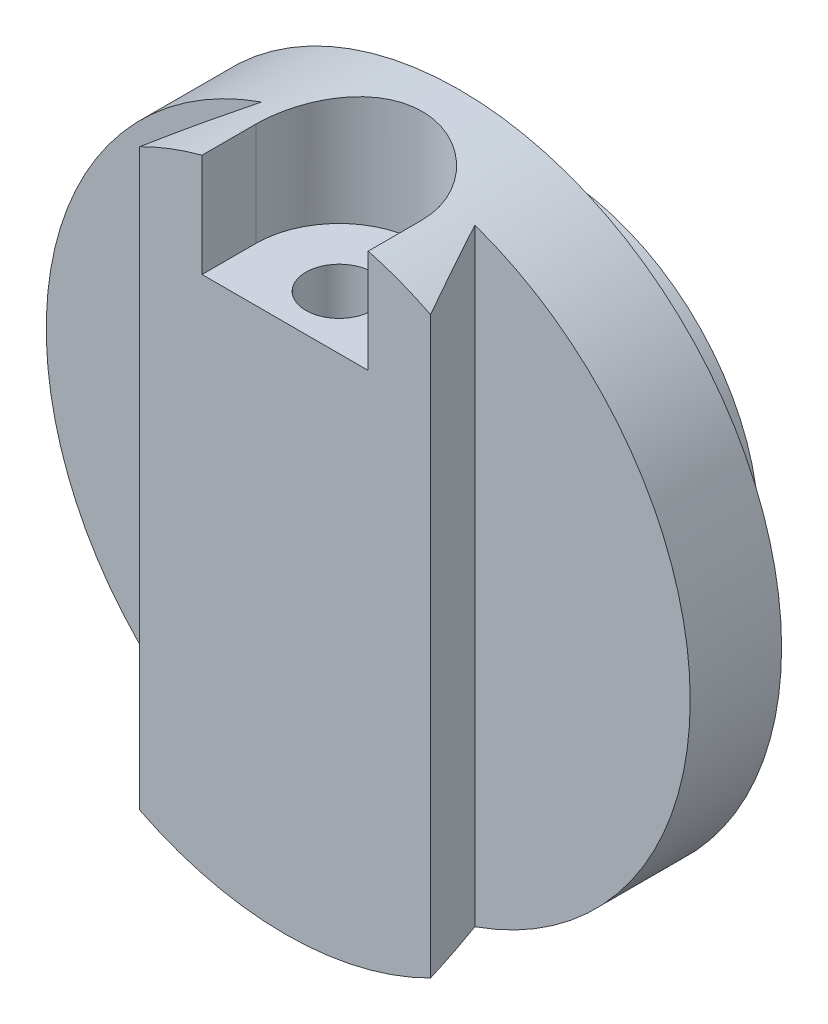
ISO-10303-21;
HEADER;
FILE_DESCRIPTION(('STEP AP214'),'2;1');
FILE_NAME('part.step','',(''),(''),'','','');
FILE_SCHEMA(('AUTOMOTIVE_DESIGN { 1 0 10303 214 1 1 1 1 }'));
ENDSEC;
DATA;
#1=APPLICATION_CONTEXT('core data for automotive mechanical design processes');
#2=APPLICATION_PROTOCOL_DEFINITION('international standard','automotive_design',2000,#1);
#3=PRODUCT_CONTEXT('',#1,'mechanical');
#4=PRODUCT('Part','Part','',(#3));
#5=PRODUCT_RELATED_PRODUCT_CATEGORY('part','',(#4));
#6=PRODUCT_DEFINITION_FORMATION('','',#4);
#7=PRODUCT_DEFINITION_CONTEXT('part definition',#1,'design');
#8=PRODUCT_DEFINITION('design','',#6,#7);
#9=PRODUCT_DEFINITION_SHAPE('','',#8);
#10=(LENGTH_UNIT() NAMED_UNIT(*) SI_UNIT(.MILLI.,.METRE.));
#11=(NAMED_UNIT(*) PLANE_ANGLE_UNIT() SI_UNIT($,.RADIAN.));
#12=(NAMED_UNIT(*) SI_UNIT($,.STERADIAN.) SOLID_ANGLE_UNIT());
#13=UNCERTAINTY_MEASURE_WITH_UNIT(LENGTH_MEASURE(1.E-05),#10,'distance_accuracy_value','');
#14=(GEOMETRIC_REPRESENTATION_CONTEXT(3) GLOBAL_UNCERTAINTY_ASSIGNED_CONTEXT((#13)) GLOBAL_UNIT_ASSIGNED_CONTEXT((#10,
#11,#12)) REPRESENTATION_CONTEXT('',''));
#15=CARTESIAN_POINT('',(0.,0.,0.));
#16=DIRECTION('',(0.,0.,1.));
#17=DIRECTION('',(1.,0.,0.));
#18=AXIS2_PLACEMENT_3D('',#15,#16,#17);
#19=CARTESIAN_POINT('',(0.,0.,64.));
#20=DIRECTION('',(0.,0.,-1.));
#21=DIRECTION('',(-1.,0.,0.));
#22=AXIS2_PLACEMENT_3D('',#19,#20,#21);
#23=CYLINDRICAL_SURFACE('',#22,77.5);
#24=CARTESIAN_POINT('',(0.,-77.5,58.9999999999999));
#25=CARTESIAN_POINT('',(0.22412144041309,-77.5000006289321,59.0000022456174));
#26=CARTESIAN_POINT('',(0.448208760643072,-77.4990258403276,58.9905782649997));
#27=CARTESIAN_POINT('',(0.894856484115019,-77.4951552624996,58.9529525780493));
#28=CARTESIAN_POINT('',(1.11741651072026,-77.4922590155015,58.9247463969774));
#29=CARTESIAN_POINT('',(1.5595222457554,-77.4846231282553,58.8497266191283));
#30=CARTESIAN_POINT('',(1.77906542690297,-77.4798820296715,58.8028983011046));
#31=CARTESIAN_POINT('',(2.21348185336275,-77.4686886840392,58.69095745594));
#32=CARTESIAN_POINT('',(2.42835335836776,-77.4622358107438,58.6258382366232));
#33=CARTESIAN_POINT('',(2.85164760131742,-77.4478077302911,58.4778563410954));
#34=CARTESIAN_POINT('',(3.06007541873765,-77.439833759692,58.3950080708902));
#35=CARTESIAN_POINT('',(3.4692011726306,-77.4225843642534,58.2121322102676));
#36=CARTESIAN_POINT('',(3.66989896334979,-77.4133089148891,58.1121042961133));
#37=CARTESIAN_POINT('',(4.06211045206069,-77.3937194475438,57.8956089506082));
#38=CARTESIAN_POINT('',(4.25362618380569,-77.3834056611296,57.7791451824161));
#39=CARTESIAN_POINT('',(4.62618990430687,-77.3620267956708,57.5305830733126));
#40=CARTESIAN_POINT('',(4.80723761980854,-77.3509616970305,57.3984843245435));
#41=CARTESIAN_POINT('',(5.1581638018345,-77.3283542274609,57.1191342598021));
#42=CARTESIAN_POINT('',(5.32800446372237,-77.3168104356773,56.9718355657215));
#43=CARTESIAN_POINT('',(5.65474382854309,-77.2936007272178,56.6634229167924));
#44=CARTESIAN_POINT('',(5.81163802450728,-77.2819347695924,56.502304190343));
#45=CARTESIAN_POINT('',(6.11129737925743,-77.2588158807326,56.1674479791581));
#46=CARTESIAN_POINT('',(6.25406441089398,-77.2473629214248,55.9937121723893));
#47=CARTESIAN_POINT('',(6.52448854623247,-77.22499248345,55.6348175347842));
#48=CARTESIAN_POINT('',(6.65214542874813,-77.2140750126231,55.4496585367926));
#49=CARTESIAN_POINT('',(6.89171122560251,-77.1930619565953,55.0687889262736));
#50=CARTESIAN_POINT('',(7.00358400285714,-77.1829682789962,54.8730554755148));
#51=CARTESIAN_POINT('',(7.21043841339032,-77.1639188511048,54.4727982359632));
#52=CARTESIAN_POINT('',(7.3054196408647,-77.1549631281524,54.2682742361319));
#53=CARTESIAN_POINT('',(7.477781995392,-77.1384487520527,53.8519340433341));
#54=CARTESIAN_POINT('',(7.55516674049758,-77.1308898117697,53.6401193597526));
#55=CARTESIAN_POINT('',(7.6918195263402,-77.1173821713805,53.2105929368656));
#56=CARTESIAN_POINT('',(7.75108131476702,-77.1114340270698,52.9928791905544));
#57=CARTESIAN_POINT('',(7.85082747054436,-77.1013424937746,52.5540128253052));
#58=CARTESIAN_POINT('',(7.89138162571125,-77.0971924008391,52.3328762207178));
#59=CARTESIAN_POINT('',(7.95374235887186,-77.0907839330074,51.8879447790906));
#60=CARTESIAN_POINT('',(7.97554871346777,-77.0885255806531,51.6641499104074));
#61=CARTESIAN_POINT('',(8.00025127878499,-77.085965873048,51.2155174174074));
#62=CARTESIAN_POINT('',(8.00314830117601,-77.0856644337981,50.9906798382628));
#63=CARTESIAN_POINT('',(7.99001273813123,-77.0870270519928,50.5415595704086));
#64=CARTESIAN_POINT('',(7.9739797720361,-77.088691148962,50.3172768929483));
#65=CARTESIAN_POINT('',(7.92320564265994,-77.0939262108477,49.8717850305153));
#66=CARTESIAN_POINT('',(7.88854065438163,-77.0974894109924,49.6505670671124));
#67=CARTESIAN_POINT('',(7.80078982902067,-77.1064175076918,49.2117731379946));
#68=CARTESIAN_POINT('',(7.74769764521342,-77.111783024983,48.9941984542036));
#69=CARTESIAN_POINT('',(7.62349169311528,-77.1241613544967,48.5643447660147));
#70=CARTESIAN_POINT('',(7.55238102981571,-77.1311738828867,48.3520648561235));
#71=CARTESIAN_POINT('',(7.39264525299236,-77.1466475608227,47.9342507453281));
#72=CARTESIAN_POINT('',(7.30401978952844,-77.1551087393117,47.7287166792995));
#73=CARTESIAN_POINT('',(7.10970680130189,-77.1732570453895,47.3254582479223));
#74=CARTESIAN_POINT('',(7.00398752268007,-77.1829464471736,47.1277492863368));
#75=CARTESIAN_POINT('',(6.77635621224708,-77.2032644867963,46.7419292841438));
#76=CARTESIAN_POINT('',(6.65444380793458,-77.2138931462393,46.5538184644667));
#77=CARTESIAN_POINT('',(6.39530953848221,-77.2357877785603,46.1885394167798));
#78=CARTESIAN_POINT('',(6.25809007618134,-77.2470536512745,46.01136947808));
#79=CARTESIAN_POINT('',(5.96923867604752,-77.2699112153228,45.6691134987661));
#80=CARTESIAN_POINT('',(5.81760174913516,-77.2815030184589,45.504031676411));
#81=CARTESIAN_POINT('',(5.5002974737331,-77.3047355593271,45.1864520561252));
#82=CARTESIAN_POINT('',(5.33456974313492,-77.3163762811419,45.0340145802931));
#83=CARTESIAN_POINT('',(4.99084224557343,-77.3393247688625,44.7436342848612));
#84=CARTESIAN_POINT('',(4.81284228003316,-77.3506325293763,44.6056916998944));
#85=CARTESIAN_POINT('',(4.44582570714483,-77.3725947740679,44.3452827769776));
#86=CARTESIAN_POINT('',(4.25680925661626,-77.3832492675404,44.2228162188051));
#87=CARTESIAN_POINT('',(3.86908368170646,-77.4036037399262,43.9942282217026));
#88=CARTESIAN_POINT('',(3.67037435744399,-77.4133036991431,43.8881071200275));
#89=CARTESIAN_POINT('',(3.26466756370417,-77.4314740415084,43.6929749749447));
#90=CARTESIAN_POINT('',(3.05766999748072,-77.4399444102988,43.6039641313301));
#91=CARTESIAN_POINT('',(2.63678409197879,-77.4554176656049,43.4436717536236));
#92=CARTESIAN_POINT('',(2.4228933842077,-77.462420041378,43.3723963884339));
#93=CARTESIAN_POINT('',(1.98990774693591,-77.4747516967645,43.2481632385807));
#94=CARTESIAN_POINT('',(1.77081506605635,-77.4800816856197,43.1951976879451));
#95=CARTESIAN_POINT('',(1.32880759873042,-77.488922761536,43.1079128321088));
#96=CARTESIAN_POINT('',(1.10589114796409,-77.4924330346764,43.0736018703805));
#97=CARTESIAN_POINT('',(0.658963993266934,-77.4975191796241,43.0240307777105));
#98=CARTESIAN_POINT('',(0.434962996988856,-77.4991038494751,43.0086839943209));
#99=CARTESIAN_POINT('',(-0.0134443765486324,-77.500322994829,42.9968694049881));
#100=CARTESIAN_POINT('',(-0.237850535116094,-77.4999583182518,43.0003933907053));
#101=CARTESIAN_POINT('',(-0.685610633888314,-77.4972907524117,43.0262782312841));
#102=CARTESIAN_POINT('',(-0.90896433653478,-77.4949874448335,43.0486431516181));
#103=CARTESIAN_POINT('',(-1.3529707516993,-77.4885073204368,43.1120497405359));
#104=CARTESIAN_POINT('',(-1.57362353842967,-77.4843305552141,43.1530908947695));
#105=CARTESIAN_POINT('',(-2.01018362661922,-77.4742327009578,43.2534384702333));
#106=CARTESIAN_POINT('',(-2.22610028707932,-77.4683154635325,43.3127045732758));
#107=CARTESIAN_POINT('',(-2.65216150328002,-77.4548995880078,43.4491012454989));
#108=CARTESIAN_POINT('',(-2.86230612489521,-77.4474009679649,43.5262316107051));
#109=CARTESIAN_POINT('',(-3.2753903415041,-77.4310309782942,43.6978189413456));
#110=CARTESIAN_POINT('',(-3.47832852645126,-77.4221593418152,43.7922792755925));
#111=CARTESIAN_POINT('',(-3.8754704492477,-77.4032960607971,43.9978072612485));
#112=CARTESIAN_POINT('',(-4.06967712664901,-77.3933047972087,44.1088692682441));
#113=CARTESIAN_POINT('',(-4.44878902133798,-77.3724399108398,44.3472858128548));
#114=CARTESIAN_POINT('',(-4.63365660521503,-77.3615631180707,44.4746999171251));
#115=CARTESIAN_POINT('',(-4.99200820091474,-77.3392661526231,44.7445889508585));
#116=CARTESIAN_POINT('',(-5.16549245691963,-77.3278459916094,44.8870635570896));
#117=CARTESIAN_POINT('',(-5.49987812285569,-77.3047827466601,45.1860814343108));
#118=CARTESIAN_POINT('',(-5.66077898234948,-77.2931396530003,45.3426253200925));
#119=CARTESIAN_POINT('',(-5.96886214250702,-77.2699589420821,45.6686783374357));
#120=CARTESIAN_POINT('',(-6.11604464102973,-77.2584213233044,45.838187281939));
#121=CARTESIAN_POINT('',(-6.39622728097,-77.2357308369963,46.1896989918624));
#122=CARTESIAN_POINT('',(-6.52916766408467,-77.2245797140181,46.3717495085912));
#123=CARTESIAN_POINT('',(-6.77918871074659,-77.2030332656618,46.7463784698501));
#124=CARTESIAN_POINT('',(-6.89627521392881,-77.1926376626518,46.9389530010661));
#125=CARTESIAN_POINT('',(-7.11384666245387,-77.1728911488181,47.3334027903196));
#126=CARTESIAN_POINT('',(-7.21432577171023,-77.1635406056162,47.5352812861733));
#127=CARTESIAN_POINT('',(-7.39787428000679,-77.1461597040211,47.9467735119188));
#128=CARTESIAN_POINT('',(-7.4809497974271,-77.1381288818835,48.1563844928081));
#129=CARTESIAN_POINT('',(-7.62900614292368,-77.1236266879278,48.5815596708896));
#130=CARTESIAN_POINT('',(-7.69401714740278,-77.1171527178847,48.7971132706638));
#131=CARTESIAN_POINT('',(-7.80565250209555,-77.1059332347639,49.232969758358));
#132=CARTESIAN_POINT('',(-7.85227727249769,-77.1011876821861,49.4532725376216));
#133=CARTESIAN_POINT('',(-7.9267984194321,-77.0935618091398,49.8970538393885));
#134=CARTESIAN_POINT('',(-7.95469492778901,-77.0906814755423,50.1205323395273));
#135=CARTESIAN_POINT('',(-7.99155312594365,-77.0868693320342,50.5690581791066));
#136=CARTESIAN_POINT('',(-8.00051517074663,-77.085937485591,50.7941054890539));
#137=CARTESIAN_POINT('',(-7.99944152492069,-77.0860488989122,51.2431338910804));
#138=CARTESIAN_POINT('',(-7.9894917014318,-77.0870832314715,51.4671151954));
#139=CARTESIAN_POINT('',(-7.95084370123036,-77.0910789941078,51.9133583671144));
#140=CARTESIAN_POINT('',(-7.92215206055208,-77.0940397523604,52.1356208066153));
#141=CARTESIAN_POINT('',(-7.84623013604892,-77.1018036521019,52.5769652111321));
#142=CARTESIAN_POINT('',(-7.79899646709564,-77.1066071300036,52.796046587819));
#143=CARTESIAN_POINT('',(-7.68633648416365,-77.117919010914,53.2294302024073));
#144=CARTESIAN_POINT('',(-7.62091054315141,-77.1244273789701,53.4437325381882));
#145=CARTESIAN_POINT('',(-7.47235068069638,-77.1389625281308,53.8660193985515));
#146=CARTESIAN_POINT('',(-7.38921937977867,-77.1469890845127,54.0740048528798));
#147=CARTESIAN_POINT('',(-7.2058414077743,-77.1643332499751,54.4822288683681));
#148=CARTESIAN_POINT('',(-7.10559493480162,-77.1736508441113,54.682467519167));
#149=CARTESIAN_POINT('',(-6.88868164692852,-77.1933152569996,55.0738346252506));
#150=CARTESIAN_POINT('',(-6.7720120798586,-77.2036622481719,55.2649615463976));
#151=CARTESIAN_POINT('',(-6.52313218976206,-77.2250887629648,55.6366753174278));
#152=CARTESIAN_POINT('',(-6.39092715127556,-77.2361680369346,55.8172657203074));
#153=CARTESIAN_POINT('',(-6.11121264176826,-77.2588043762888,56.1675478334074));
#154=CARTESIAN_POINT('',(-5.96363396201531,-77.2703634478196,56.3371841528292));
#155=CARTESIAN_POINT('',(-5.65473392080187,-77.293582955411,56.6634307272365));
#156=CARTESIAN_POINT('',(-5.49341283878869,-77.3052433894061,56.8200412469694));
#157=CARTESIAN_POINT('',(-5.15811288053115,-77.3283396378945,57.119179827032));
#158=CARTESIAN_POINT('',(-4.98413073900976,-77.3397753934709,57.2617042320561));
#159=CARTESIAN_POINT('',(-4.62476807922271,-77.3620961643922,57.5316168184361));
#160=CARTESIAN_POINT('',(-4.43938774560957,-77.3729811886539,57.6590052448993));
#161=CARTESIAN_POINT('',(-4.05798002344993,-77.3939233524935,57.8980866779505));
#162=CARTESIAN_POINT('',(-3.86192366629876,-77.4039780320949,58.0097336947715));
#163=CARTESIAN_POINT('',(-3.4611144725406,-77.4229353661449,58.2160567023354));
#164=CARTESIAN_POINT('',(-3.25636485548308,-77.4318384422312,58.3107389093395));
#165=CARTESIAN_POINT('',(-2.83972007448798,-77.4482369350069,58.4824266941205));
#166=CARTESIAN_POINT('',(-2.62783089319213,-77.4557334973127,58.559446669388));
#167=CARTESIAN_POINT('',(-2.19833332306081,-77.4691132476432,58.6953276309041));
#168=CARTESIAN_POINT('',(-1.98072634665206,-77.4749968300806,58.7541930568208));
#169=CARTESIAN_POINT('',(-1.47239361489212,-77.4865488610836,58.8688961990982));
#170=CARTESIAN_POINT('',(-1.18011114473312,-77.4915729017231,58.9180124800809));
#171=CARTESIAN_POINT('',(-0.591865946655075,-77.4982980485787,58.9835628251396));
#172=CARTESIAN_POINT('',(-0.295903235175733,-77.4999991696331,58.9999970351542));
#173=CARTESIAN_POINT('',(0.,-77.5,58.9999999999999));
#174=B_SPLINE_CURVE_WITH_KNOTS('',3,(#24,#25,#26,#27,#28,#29,#30,#31,#32,#33,#34,#35,#36,#37,
#38,#39,#40,#41,#42,#43,#44,#45,#46,#47,#48,#49,#50,#51,#52,#53,#54,#55,#56,#57,#58,#59,#60,#61,
#62,#63,#64,#65,#66,#67,#68,#69,#70,#71,#72,#73,#74,#75,#76,#77,#78,#79,#80,#81,#82,#83,#84,#85,
#86,#87,#88,#89,#90,#91,#92,#93,#94,#95,#96,#97,#98,#99,#100,#101,#102,#103,#104,#105,#106,#107,
#108,#109,#110,#111,#112,#113,#114,#115,#116,#117,#118,#119,#120,#121,#122,#123,#124,#125,#126,
#127,#128,#129,#130,#131,#132,#133,#134,#135,#136,#137,#138,#139,#140,#141,#142,#143,#144,#145,
#146,#147,#148,#149,#150,#151,#152,#153,#154,#155,#156,#157,#158,#159,#160,#161,#162,#163,#164,
#165,#166,#167,#168,#169,#170,#171,#172,#173),.UNSPECIFIED.,.T.,.F.,(4,2,2,2,2,2,2,2,2,2,2,2,2,
2,2,2,2,2,2,2,2,2,2,2,2,2,2,2,2,2,2,2,2,2,2,2,2,2,2,2,2,2,2,2,2,2,2,2,2,2,2,2,2,2,2,2,2,2,2,2,2,
2,2,2,2,2,2,2,2,2,2,2,2,2,4),(0.,0.672105538050494,1.34437125825977,2.01716948049535,
2.69021418386623,3.36271405734616,4.03522660494769,4.70758950161536,5.37996994156125,
6.05451340122764,6.72929070323652,7.40397842924014,8.07867603027712,8.75489409388205,
9.4311284008188,10.1072235397061,10.7835516648679,11.4573359649636,12.131128293726,
12.8048917002393,13.4786686555564,14.1497116701379,14.8209860361725,15.4921448050348,
16.1633169847922,16.8357505839645,17.5081996542573,18.1805433144088,18.8531204878582,
19.528741036446,20.2043725198134,20.8799943879253,21.5556301942437,22.2312738893515,
22.907152265016,23.5827436191421,24.2586368909614,24.9314302656864,25.6039310149344,
26.2765769127009,26.9492042866842,27.6203542156407,28.2914964817732,28.9627693513037,
29.6338145112588,30.3073774567906,30.9809259490877,31.6545038880564,32.3280721105547,
33.004364148197,33.6804063980954,34.3566857165452,35.0327268828024,35.7076318522394,
36.3825213968907,37.0574061910743,37.7322783316236,38.4040936114833,39.0756747270118,
39.7473785069191,40.4190685169949,41.0906591809495,41.7622420715388,42.4339376397514,
43.1054053820678,43.7800384935613,44.4546578898814,45.1294518908319,45.8042349628907,
46.4809503335403,47.1574172321574,47.8333307282655,48.5090787994243,49.3964508009562,
50.2838188400077),.UNSPECIFIED.);
#175=CARTESIAN_POINT('',(0.,-77.5,58.9999999999999));
#176=VERTEX_POINT('',#175);
#177=EDGE_CURVE('E130',#176,#176,#174,.T.);
#178=ORIENTED_EDGE('',*,*,#177,.T.);
#179=EDGE_LOOP('',(#178));
#180=FACE_BOUND('',#179,.T.);
#181=CARTESIAN_POINT('',(0.,0.,22.));
#182=DIRECTION('',(0.,0.,1.));
#183=DIRECTION('',(1.,0.,0.));
#184=AXIS2_PLACEMENT_3D('',#181,#182,#183);
#185=CIRCLE('',#184,77.5);
#186=CARTESIAN_POINT('',(77.5,0.,22.));
#187=VERTEX_POINT('',#186);
#188=EDGE_CURVE('E166',#187,#187,#185,.T.);
#189=ORIENTED_EDGE('',*,*,#188,.T.);
#190=EDGE_LOOP('',(#189));
#191=FACE_BOUND('',#190,.T.);
#192=CARTESIAN_POINT('',(20.,74.8748956593597,50.9999999999999));
#193=CARTESIAN_POINT('',(20.0000009009876,74.8748931596205,50.7237468245864));
#194=CARTESIAN_POINT('',(19.9942755437757,74.8764250036867,50.4475255628795));
#195=CARTESIAN_POINT('',(19.971394276126,74.8825321102263,49.8955991110094));
#196=CARTESIAN_POINT('',(19.954238720306,74.8871072782817,49.6198939051019));
#197=CARTESIAN_POINT('',(19.8856770260191,74.905355256611,48.7944200261904));
#198=CARTESIAN_POINT('',(19.8171758239038,74.9235505794285,48.2460765472726));
#199=CARTESIAN_POINT('',(19.6353414752994,74.9714089052939,47.1585553826101));
#200=CARTESIAN_POINT('',(19.5221008953686,75.0010482276478,46.6193611542153));
#201=CARTESIAN_POINT('',(19.3193923283769,75.0534200553383,45.81957672225));
#202=CARTESIAN_POINT('',(19.2463430090242,75.0721974549676,45.5544679740222));
#203=CARTESIAN_POINT('',(19.0894196849758,75.1122534668049,45.0275944419359));
#204=CARTESIAN_POINT('',(19.0055430549676,75.1335326855203,44.7658304860666));
#205=CARTESIAN_POINT('',(18.7379988018029,75.2008732843106,43.9865177085328));
#206=CARTESIAN_POINT('',(18.5383456714187,75.2504562162705,43.4746676233953));
#207=CARTESIAN_POINT('',(18.0979783084092,75.3575773188224,42.4698110444774));
#208=CARTESIAN_POINT('',(17.8572630449466,75.4151156891235,41.9768050241451));
#209=CARTESIAN_POINT('',(17.4667420800412,75.506163728196,41.2538188233383));
#210=CARTESIAN_POINT('',(17.3316160092084,75.5373130875086,41.015509069932));
#211=CARTESIAN_POINT('',(17.0518157404656,75.60096671319,40.5448328820701));
#212=CARTESIAN_POINT('',(16.9071439993201,75.6334706301497,40.3124649395708));
#213=CARTESIAN_POINT('',(16.4590905794614,75.7327006036271,39.6246898732024));
#214=CARTESIAN_POINT('',(16.14165249156,75.8011491748772,39.178577812723));
#215=CARTESIAN_POINT('',(15.4645151860238,75.9422204171041,38.3050949655875));
#216=CARTESIAN_POINT('',(15.1040682712976,76.014900567495,37.8783147448651));
#217=CARTESIAN_POINT('',(14.3488180699059,76.1610748234075,37.0564402687843));
#218=CARTESIAN_POINT('',(13.9540142882549,76.2345689406427,36.6613464700953));
#219=CARTESIAN_POINT('',(13.1325709774323,76.3803611900756,35.9053917556854));
#220=CARTESIAN_POINT('',(12.7059264478875,76.452659132235,35.5445362371503));
#221=CARTESIAN_POINT('',(11.8236088009082,76.5940719680364,34.859547879969));
#222=CARTESIAN_POINT('',(11.3679355564728,76.6631868477502,34.5354152020028));
#223=CARTESIAN_POINT('',(10.4234962203619,76.7973408124367,33.9215740403419));
#224=CARTESIAN_POINT('',(9.93433692187898,76.8623034181686,33.6324533520975));
#225=CARTESIAN_POINT('',(8.93248470890438,76.9851633843514,33.0965523104566));
#226=CARTESIAN_POINT('',(8.41979148614505,77.0430606522181,32.8497725118782));
#227=CARTESIAN_POINT('',(7.37454957741461,77.1501259380721,32.4005500693068));
#228=CARTESIAN_POINT('',(6.8420042861413,77.1992954402945,32.1980998852929));
#229=CARTESIAN_POINT('',(5.76082393869374,77.2874959715896,31.8391720681556));
#230=CARTESIAN_POINT('',(5.21218928348503,77.32652725308,31.6826932904407));
#231=CARTESIAN_POINT('',(4.11484145133854,77.3925945137087,31.4199205789405));
#232=CARTESIAN_POINT('',(3.56638376976515,77.4198704371308,31.3126196347942));
#233=CARTESIAN_POINT('',(2.46196707517977,77.4628561210342,31.1442521873455));
#234=CARTESIAN_POINT('',(1.90600815928464,77.4785660311122,31.083185086047));
#235=CARTESIAN_POINT('',(0.790783769006069,77.4979719135676,31.0078270377904));
#236=CARTESIAN_POINT('',(0.231518681213759,77.5016692637881,30.9935307262115));
#237=CARTESIAN_POINT('',(-0.886188605544961,77.4969481729186,31.0118270414785));
#238=CARTESIAN_POINT('',(-1.44463081533981,77.4885298927121,31.0444190456937));
#239=CARTESIAN_POINT('',(-2.54334334193698,77.4601591406109,31.1548744763788));
#240=CARTESIAN_POINT('',(-3.08373085917167,77.4404844723763,31.2316477822233));
#241=CARTESIAN_POINT('',(-4.15593270580974,77.3903498968344,31.4289664642334));
#242=CARTESIAN_POINT('',(-4.68774719350374,77.3598901888988,31.5495110312467));
#243=CARTESIAN_POINT('',(-5.73915279757475,77.2890016813501,31.8333974601736));
#244=CARTESIAN_POINT('',(-6.25874361277398,77.2485726363847,31.9967403753902));
#245=CARTESIAN_POINT('',(-7.28220520253822,77.1588193666629,32.364945300221));
#246=CARTESIAN_POINT('',(-7.78607574247262,77.1094950092153,32.5698079291897));
#247=CARTESIAN_POINT('',(-8.77948961613064,77.0027435280766,33.0216481442706));
#248=CARTESIAN_POINT('',(-9.26885208341606,76.9452440945723,33.2690061871334));
#249=CARTESIAN_POINT('',(-10.2250429824405,76.8240247960702,33.802666410005));
#250=CARTESIAN_POINT('',(-10.6918713312755,76.7603049081896,34.0889687332768));
#251=CARTESIAN_POINT('',(-11.6001141051853,76.6283106592861,34.6985729821029));
#252=CARTESIAN_POINT('',(-12.0415251585385,76.5600356965927,35.0218797995562));
#253=CARTESIAN_POINT('',(-12.8961303041403,76.4207256429532,35.7033166035306));
#254=CARTESIAN_POINT('',(-13.3093238809778,76.3496905016276,36.0614472258424));
#255=CARTESIAN_POINT('',(-14.1163696270801,76.2046652919124,36.8210051441258));
#256=CARTESIAN_POINT('',(-14.5093255625203,76.1306489487187,37.223380484097));
#257=CARTESIAN_POINT('',(-15.2600590628863,75.9837282121183,38.0598880723356));
#258=CARTESIAN_POINT('',(-15.6178357010011,75.9108238480497,38.4940211567467));
#259=CARTESIAN_POINT('',(-16.2959182395374,75.7681539627006,39.3914125111304));
#260=CARTESIAN_POINT('',(-16.6162131533412,75.6983893654157,39.8546792598717));
#261=CARTESIAN_POINT('',(-17.0666380434948,75.5976423620695,40.5688378433474));
#262=CARTESIAN_POINT('',(-17.2117803493511,75.5647091551594,40.8101073680878));
#263=CARTESIAN_POINT('',(-17.4918740141143,75.500364153728,41.2987796960963));
#264=CARTESIAN_POINT('',(-17.6268225625549,75.4689527796329,41.5461841660054));
#265=CARTESIAN_POINT('',(-18.0174429306808,75.3770103905826,42.299821433635));
#266=CARTESIAN_POINT('',(-18.2571733746856,75.3191589496118,42.814758964978));
#267=CARTESIAN_POINT('',(-18.692226828342,75.2123720487981,43.8639543841524));
#268=CARTESIAN_POINT('',(-18.8875511267263,75.1634363302158,44.3982117107728));
#269=CARTESIAN_POINT('',(-19.1459044818335,75.0978837822718,45.2107789140672));
#270=CARTESIAN_POINT('',(-19.2262228034867,75.0773486298449,45.4833777825879));
#271=CARTESIAN_POINT('',(-19.3751981332259,75.0390405542535,46.0318569999271));
#272=CARTESIAN_POINT('',(-19.4438580483931,75.0212669425793,46.3077365122874));
#273=CARTESIAN_POINT('',(-19.6320906975259,74.9723149861778,47.1394443712807));
#274=CARTESIAN_POINT('',(-19.7340166391081,74.9454798166116,47.6996574848108));
#275=CARTESIAN_POINT('',(-19.8745195602067,74.9083291363219,48.7167776979528));
#276=CARTESIAN_POINT('',(-19.9215862849935,74.8958095103566,49.1724663952272));
#277=CARTESIAN_POINT('',(-19.9843128669603,74.8790856340988,50.0854153103715));
#278=CARTESIAN_POINT('',(-20.0000230292443,74.8748680650273,50.5426718303062));
#279=CARTESIAN_POINT('',(-19.9999999999999,74.8748956593597,50.9999999999999));
#280=B_SPLINE_CURVE_WITH_KNOTS('',3,(#192,#193,#194,#195,#196,#197,#198,#199,#200,#201,#202,
#203,#204,#205,#206,#207,#208,#209,#210,#211,#212,#213,#214,#215,#216,#217,#218,#219,#220,#221,
#222,#223,#224,#225,#226,#227,#228,#229,#230,#231,#232,#233,#234,#235,#236,#237,#238,#239,#240,
#241,#242,#243,#244,#245,#246,#247,#248,#249,#250,#251,#252,#253,#254,#255,#256,#257,#258,#259,
#260,#261,#262,#263,#264,#265,#266,#267,#268,#269,#270,#271,#272,#273,#274,#275,#276,#277,#278,
#279),.UNSPECIFIED.,.F.,.F.,(4,2,2,2,2,2,2,2,2,2,2,2,2,2,2,2,2,2,2,2,2,2,2,2,2,2,2,2,2,2,2,2,2,
2,2,2,2,2,2,2,2,2,2,4),(0.,0.828632429946842,1.65723915307507,3.31380514350207,4.96696146986572,
5.79363536970013,6.62051009211123,8.27339282884408,9.92631706619977,10.7532693654569,
11.5800096563761,13.2333749573112,14.9214725647524,16.6095944969391,18.297982097346,
19.9863770849736,21.7000407200499,23.4137268085777,25.1271211895542,26.8404729069872,
28.5169730319423,30.1934514724028,31.8697376136432,33.546001495659,35.1825779790104,
36.8191242102671,38.4557107220715,40.0923216488287,41.7444312969602,43.3965470228154,
45.0488814069358,46.7012459639846,48.4010637715827,50.1009263494874,51.8012859484807,
52.6515126502899,53.5019729143953,55.2125774001065,56.9231322351781,57.7776702518468,
58.6319948713265,60.3396514668414,61.7134133581475,63.0849695561328),.UNSPECIFIED.);
#281=CARTESIAN_POINT('',(20.,74.8748956593597,50.9999999999999));
#282=VERTEX_POINT('',#281);
#283=CARTESIAN_POINT('',(-20.,74.8748956593597,50.9999999999999));
#284=VERTEX_POINT('',#283);
#285=EDGE_CURVE('E11',#282,#284,#280,.T.);
#286=ORIENTED_EDGE('',*,*,#285,.F.);
#287=DIRECTION('',(0.,0.,-1.));
#288=VECTOR('',#287,1.);
#289=CARTESIAN_POINT('',(20.,74.8748956593597,64.));
#290=LINE('',#289,#288);
#291=CARTESIAN_POINT('',(20.,74.8748956593597,64.));
#292=VERTEX_POINT('',#291);
#293=EDGE_CURVE('E118',#292,#282,#290,.T.);
#294=ORIENTED_EDGE('',*,*,#293,.F.);
#295=CARTESIAN_POINT('',(0.,0.,64.));
#296=DIRECTION('',(0.,0.,1.));
#297=DIRECTION('',(1.,0.,0.));
#298=AXIS2_PLACEMENT_3D('',#295,#296,#297);
#299=CIRCLE('',#298,77.5);
#300=CARTESIAN_POINT('',(35.,69.1465834296966,64.));
#301=VERTEX_POINT('',#300);
#302=EDGE_CURVE('E160',#301,#292,#299,.T.);
#303=ORIENTED_EDGE('',*,*,#302,.F.);
#304=CARTESIAN_POINT('',(0.,0.,-11.0577422178334));
#305=DIRECTION('',(-0.906307787036648,0.,0.422618261740705));
#306=DIRECTION('',(-0.422618261740705,0.,-0.906307787036648));
#307=AXIS2_PLACEMENT_3D('',#304,#305,#306);
#308=ELLIPSE('',#307,183.380622694316,77.5);
#309=CARTESIAN_POINT('',(25.6698058686712,73.1253107115774,43.9913341156679));
#310=VERTEX_POINT('',#309);
#311=EDGE_CURVE('E152',#301,#310,#308,.T.);
#312=ORIENTED_EDGE('',*,*,#311,.T.);
#313=CARTESIAN_POINT('',(0.,0.,43.9913341156679));
#314=DIRECTION('',(0.,0.,-1.));
#315=DIRECTION('',(-1.,0.,0.));
#316=AXIS2_PLACEMENT_3D('',#313,#314,#315);
#317=CIRCLE('',#316,77.5);
#318=CARTESIAN_POINT('',(25.6698058686712,-73.1253107115774,43.9913341156679));
#319=VERTEX_POINT('',#318);
#320=EDGE_CURVE('E178',#310,#319,#317,.T.);
#321=ORIENTED_EDGE('',*,*,#320,.T.);
#322=CARTESIAN_POINT('',(35.,-69.1465834296966,64.));
#323=VERTEX_POINT('',#322);
#324=EDGE_CURVE('E157',#319,#323,#308,.T.);
#325=ORIENTED_EDGE('',*,*,#324,.T.);
#326=CARTESIAN_POINT('',(-35.,-69.1465834296966,64.));
#327=VERTEX_POINT('',#326);
#328=EDGE_CURVE('E165',#327,#323,#299,.T.);
#329=ORIENTED_EDGE('',*,*,#328,.F.);
#330=CARTESIAN_POINT('',(0.,0.,-11.0577422178336));
#331=DIRECTION('',(0.906307787036648,0.,0.422618261740704));
#332=DIRECTION('',(0.422618261740704,0.,-0.906307787036648));
#333=AXIS2_PLACEMENT_3D('',#330,#331,#332);
#334=ELLIPSE('',#333,183.380622694317,77.5);
#335=CARTESIAN_POINT('',(-25.6738468368999,-73.1238920503785,44.));
#336=VERTEX_POINT('',#335);
#337=EDGE_CURVE('E68',#327,#336,#334,.T.);
#338=ORIENTED_EDGE('',*,*,#337,.T.);
#339=CARTESIAN_POINT('',(0.,0.,44.));
#340=DIRECTION('',(0.,0.,-1.));
#341=DIRECTION('',(-1.,0.,0.));
#342=AXIS2_PLACEMENT_3D('',#339,#340,#341);
#343=CIRCLE('',#342,77.5);
#344=CARTESIAN_POINT('',(-25.6738468368999,73.1238920503785,44.));
#345=VERTEX_POINT('',#344);
#346=EDGE_CURVE('E181',#336,#345,#343,.T.);
#347=ORIENTED_EDGE('',*,*,#346,.T.);
#348=CARTESIAN_POINT('',(-35.,69.1465834296967,64.));
#349=VERTEX_POINT('',#348);
#350=EDGE_CURVE('E159',#345,#349,#334,.T.);
#351=ORIENTED_EDGE('',*,*,#350,.T.);
#352=CARTESIAN_POINT('',(-20.,74.8748956593597,64.));
#353=VERTEX_POINT('',#352);
#354=EDGE_CURVE('E164',#353,#349,#299,.T.);
#355=ORIENTED_EDGE('',*,*,#354,.F.);
#356=DIRECTION('',(0.,0.,-1.));
#357=VECTOR('',#356,1.);
#358=CARTESIAN_POINT('',(-20.,74.8748956593597,64.));
#359=LINE('',#358,#357);
#360=EDGE_CURVE('E146',#284,#353,#359,.F.);
#361=ORIENTED_EDGE('',*,*,#360,.F.);
#362=EDGE_LOOP('',(#286,#294,#303,#312,#321,#325,#329,#338,#347,#351,#355,#361));
#363=FACE_BOUND('',#362,.T.);
#364=ADVANCED_FACE('F39',(#180,#191,#363),#23,.T.);
#365=CARTESIAN_POINT('',(0.,0.,64.));
#366=DIRECTION('',(0.,0.,1.));
#367=DIRECTION('',(1.,0.,0.));
#368=AXIS2_PLACEMENT_3D('',#365,#366,#367);
#369=PLANE('',#368);
#370=DIRECTION('',(1.,0.,0.));
#371=VECTOR('',#370,1.);
#372=CARTESIAN_POINT('',(-20.,50.,64.));
#373=LINE('',#372,#371);
#374=CARTESIAN_POINT('',(-20.,50.,64.));
#375=VERTEX_POINT('',#374);
#376=CARTESIAN_POINT('',(20.,50.,64.));
#377=VERTEX_POINT('',#376);
#378=EDGE_CURVE('E124',#375,#377,#373,.T.);
#379=ORIENTED_EDGE('',*,*,#378,.F.);
#380=DIRECTION('',(0.,1.,0.));
#381=VECTOR('',#380,1.);
#382=CARTESIAN_POINT('',(-20.,0.,64.));
#383=LINE('',#382,#381);
#384=EDGE_CURVE('E53',#375,#353,#383,.T.);
#385=ORIENTED_EDGE('',*,*,#384,.T.);
#386=ORIENTED_EDGE('',*,*,#354,.T.);
#387=DIRECTION('',(0.,1.,0.));
#388=VECTOR('',#387,1.);
#389=CARTESIAN_POINT('',(-35.,0.,64.));
#390=LINE('',#389,#388);
#391=EDGE_CURVE('E176',#327,#349,#390,.T.);
#392=ORIENTED_EDGE('',*,*,#391,.F.);
#393=ORIENTED_EDGE('',*,*,#328,.T.);
#394=DIRECTION('',(0.,-1.,0.));
#395=VECTOR('',#394,1.);
#396=CARTESIAN_POINT('',(35.,0.,64.));
#397=LINE('',#396,#395);
#398=EDGE_CURVE('E172',#301,#323,#397,.T.);
#399=ORIENTED_EDGE('',*,*,#398,.F.);
#400=ORIENTED_EDGE('',*,*,#302,.T.);
#401=DIRECTION('',(0.,-1.,0.));
#402=VECTOR('',#401,1.);
#403=CARTESIAN_POINT('',(20.,0.,64.));
#404=LINE('',#403,#402);
#405=EDGE_CURVE('E184',#292,#377,#404,.T.);
#406=ORIENTED_EDGE('',*,*,#405,.T.);
#407=EDGE_LOOP('',(#379,#385,#386,#392,#393,#399,#400,#406));
#408=FACE_BOUND('',#407,.T.);
#409=ADVANCED_FACE('F188',(#408),#369,.T.);
#410=CARTESIAN_POINT('',(0.,0.,22.));
#411=DIRECTION('',(0.,0.,-1.));
#412=DIRECTION('',(-1.,0.,0.));
#413=AXIS2_PLACEMENT_3D('',#410,#411,#412);
#414=CYLINDRICAL_SURFACE('',#413,50.);
#415=CARTESIAN_POINT('',(0.,0.,22.));
#416=DIRECTION('',(0.,0.,1.));
#417=DIRECTION('',(1.,0.,0.));
#418=AXIS2_PLACEMENT_3D('',#415,#416,#417);
#419=CIRCLE('',#418,50.);
#420=CARTESIAN_POINT('',(50.,0.,22.));
#421=VERTEX_POINT('',#420);
#422=EDGE_CURVE('E169',#421,#421,#419,.T.);
#423=ORIENTED_EDGE('',*,*,#422,.F.);
#424=EDGE_LOOP('',(#423));
#425=FACE_BOUND('',#424,.T.);
#426=CARTESIAN_POINT('',(0.,0.,0.));
#427=DIRECTION('',(0.,0.,1.));
#428=DIRECTION('',(1.,0.,0.));
#429=AXIS2_PLACEMENT_3D('',#426,#427,#428);
#430=CIRCLE('',#429,50.);
#431=CARTESIAN_POINT('',(50.,0.,0.));
#432=VERTEX_POINT('',#431);
#433=EDGE_CURVE('E163',#432,#432,#430,.T.);
#434=ORIENTED_EDGE('',*,*,#433,.T.);
#435=EDGE_LOOP('',(#434));
#436=FACE_BOUND('',#435,.T.);
#437=ADVANCED_FACE('F41',(#425,#436),#414,.T.);
#438=CARTESIAN_POINT('',(0.,0.,0.));
#439=DIRECTION('',(0.,0.,1.));
#440=DIRECTION('',(1.,0.,0.));
#441=AXIS2_PLACEMENT_3D('',#438,#439,#440);
#442=PLANE('',#441);
#443=ORIENTED_EDGE('',*,*,#433,.F.);
#444=EDGE_LOOP('',(#443));
#445=FACE_BOUND('',#444,.T.);
#446=ADVANCED_FACE('F210',(#445),#442,.F.);
#447=CARTESIAN_POINT('',(0.,0.,22.));
#448=DIRECTION('',(0.,0.,1.));
#449=DIRECTION('',(1.,0.,0.));
#450=AXIS2_PLACEMENT_3D('',#447,#448,#449);
#451=PLANE('',#450);
#452=ORIENTED_EDGE('',*,*,#422,.T.);
#453=EDGE_LOOP('',(#452));
#454=FACE_BOUND('',#453,.T.);
#455=ORIENTED_EDGE('',*,*,#188,.F.);
#456=EDGE_LOOP('',(#455));
#457=FACE_BOUND('',#456,.T.);
#458=ADVANCED_FACE('F202',(#454,#457),#451,.F.);
#459=CARTESIAN_POINT('',(25.6698058686712,-77.5,43.9913341156679));
#460=DIRECTION('',(0.,0.,-1.));
#461=DIRECTION('',(-1.,0.,0.));
#462=AXIS2_PLACEMENT_3D('',#459,#460,#461);
#463=PLANE('',#462);
#464=DIRECTION('',(0.,1.,0.));
#465=VECTOR('',#464,1.);
#466=CARTESIAN_POINT('',(25.6698058686712,-77.5,43.9913341156679));
#467=LINE('',#466,#465);
#468=EDGE_CURVE('E148',#319,#310,#467,.T.);
#469=ORIENTED_EDGE('',*,*,#468,.F.);
#470=ORIENTED_EDGE('',*,*,#320,.F.);
#471=EDGE_LOOP('',(#469,#470));
#472=FACE_BOUND('',#471,.T.);
#473=ADVANCED_FACE('F200',(#472),#463,.F.);
#474=CARTESIAN_POINT('',(35.,-77.5,64.));
#475=DIRECTION('',(-0.906307787036648,0.,0.422618261740705));
#476=DIRECTION('',(0.422618261740705,0.,0.906307787036648));
#477=AXIS2_PLACEMENT_3D('',#474,#475,#476);
#478=PLANE('',#477);
#479=ORIENTED_EDGE('',*,*,#468,.T.);
#480=ORIENTED_EDGE('',*,*,#311,.F.);
#481=ORIENTED_EDGE('',*,*,#398,.T.);
#482=ORIENTED_EDGE('',*,*,#324,.F.);
#483=EDGE_LOOP('',(#479,#480,#481,#482));
#484=FACE_BOUND('',#483,.T.);
#485=ADVANCED_FACE('F198',(#484),#478,.F.);
#486=CARTESIAN_POINT('',(-25.6738468368999,-77.5,44.));
#487=DIRECTION('',(0.,0.,-1.));
#488=DIRECTION('',(-1.,0.,0.));
#489=AXIS2_PLACEMENT_3D('',#486,#487,#488);
#490=PLANE('',#489);
#491=DIRECTION('',(0.,1.,0.));
#492=VECTOR('',#491,1.);
#493=CARTESIAN_POINT('',(-25.6738468368999,-77.5,44.));
#494=LINE('',#493,#492);
#495=EDGE_CURVE('E149',#336,#345,#494,.T.);
#496=ORIENTED_EDGE('',*,*,#495,.T.);
#497=ORIENTED_EDGE('',*,*,#346,.F.);
#498=EDGE_LOOP('',(#496,#497));
#499=FACE_BOUND('',#498,.T.);
#500=ADVANCED_FACE('F208',(#499),#490,.F.);
#501=CARTESIAN_POINT('',(-35.,-77.5,64.));
#502=DIRECTION('',(0.906307787036648,0.,0.422618261740704));
#503=DIRECTION('',(0.422618261740704,0.,-0.906307787036648));
#504=AXIS2_PLACEMENT_3D('',#501,#502,#503);
#505=PLANE('',#504);
#506=ORIENTED_EDGE('',*,*,#495,.F.);
#507=ORIENTED_EDGE('',*,*,#337,.F.);
#508=ORIENTED_EDGE('',*,*,#391,.T.);
#509=ORIENTED_EDGE('',*,*,#350,.F.);
#510=EDGE_LOOP('',(#506,#507,#508,#509));
#511=FACE_BOUND('',#510,.T.);
#512=ADVANCED_FACE('F248',(#511),#505,.F.);
#513=CARTESIAN_POINT('',(0.,77.5,50.9999999999999));
#514=DIRECTION('',(0.,-1.,0.));
#515=DIRECTION('',(0.,0.,-1.));
#516=AXIS2_PLACEMENT_3D('',#513,#514,#515);
#517=CYLINDRICAL_SURFACE('',#516,20.);
#518=DIRECTION('',(0.,-1.,0.));
#519=VECTOR('',#518,1.);
#520=CARTESIAN_POINT('',(20.,77.5,50.9999999999999));
#521=LINE('',#520,#519);
#522=CARTESIAN_POINT('',(20.,50.,50.9999999999999));
#523=VERTEX_POINT('',#522);
#524=EDGE_CURVE('E119',#282,#523,#521,.T.);
#525=ORIENTED_EDGE('',*,*,#524,.F.);
#526=ORIENTED_EDGE('',*,*,#285,.T.);
#527=DIRECTION('',(0.,-1.,0.));
#528=VECTOR('',#527,1.);
#529=CARTESIAN_POINT('',(-20.,77.5,50.9999999999999));
#530=LINE('',#529,#528);
#531=CARTESIAN_POINT('',(-20.,50.,50.9999999999999));
#532=VERTEX_POINT('',#531);
#533=EDGE_CURVE('E112',#284,#532,#530,.T.);
#534=ORIENTED_EDGE('',*,*,#533,.T.);
#535=CARTESIAN_POINT('',(0.,50.,50.9999999999999));
#536=DIRECTION('',(0.,1.,0.));
#537=DIRECTION('',(0.,0.,1.));
#538=AXIS2_PLACEMENT_3D('',#535,#536,#537);
#539=CIRCLE('',#538,20.);
#540=EDGE_CURVE('E115',#523,#532,#539,.T.);
#541=ORIENTED_EDGE('',*,*,#540,.F.);
#542=EDGE_LOOP('',(#525,#526,#534,#541));
#543=FACE_BOUND('',#542,.T.);
#544=ADVANCED_FACE('F114',(#543),#517,.F.);
#545=CARTESIAN_POINT('',(-20.,77.5,50.9999999999999));
#546=DIRECTION('',(1.,0.,0.));
#547=DIRECTION('',(0.,0.,-1.));
#548=AXIS2_PLACEMENT_3D('',#545,#546,#547);
#549=PLANE('',#548);
#550=ORIENTED_EDGE('',*,*,#360,.T.);
#551=ORIENTED_EDGE('',*,*,#384,.F.);
#552=DIRECTION('',(0.,0.,1.));
#553=VECTOR('',#552,1.);
#554=CARTESIAN_POINT('',(-20.,50.,50.9999999999999));
#555=LINE('',#554,#553);
#556=EDGE_CURVE('E60',#532,#375,#555,.T.);
#557=ORIENTED_EDGE('',*,*,#556,.F.);
#558=ORIENTED_EDGE('',*,*,#533,.F.);
#559=EDGE_LOOP('',(#550,#551,#557,#558));
#560=FACE_BOUND('',#559,.T.);
#561=ADVANCED_FACE('F121',(#560),#549,.T.);
#562=CARTESIAN_POINT('',(20.,77.5,50.9999999999999));
#563=DIRECTION('',(-1.,0.,0.));
#564=DIRECTION('',(0.,0.,1.));
#565=AXIS2_PLACEMENT_3D('',#562,#563,#564);
#566=PLANE('',#565);
#567=ORIENTED_EDGE('',*,*,#293,.T.);
#568=ORIENTED_EDGE('',*,*,#524,.T.);
#569=DIRECTION('',(0.,0.,-1.));
#570=VECTOR('',#569,1.);
#571=CARTESIAN_POINT('',(20.,50.,50.9999999999999));
#572=LINE('',#571,#570);
#573=EDGE_CURVE('E129',#377,#523,#572,.T.);
#574=ORIENTED_EDGE('',*,*,#573,.F.);
#575=ORIENTED_EDGE('',*,*,#405,.F.);
#576=EDGE_LOOP('',(#567,#568,#574,#575));
#577=FACE_BOUND('',#576,.T.);
#578=ADVANCED_FACE('F266',(#577),#566,.T.);
#579=CARTESIAN_POINT('',(0.,50.,50.9999999999999));
#580=DIRECTION('',(0.,1.,0.));
#581=DIRECTION('',(0.,0.,1.));
#582=AXIS2_PLACEMENT_3D('',#579,#580,#581);
#583=PLANE('',#582);
#584=CARTESIAN_POINT('',(0.,50.,50.9999999999999));
#585=DIRECTION('',(0.,1.,0.));
#586=DIRECTION('',(0.,0.,1.));
#587=AXIS2_PLACEMENT_3D('',#584,#585,#586);
#588=CIRCLE('',#587,8.);
#589=CARTESIAN_POINT('',(0.,50.,58.9999999999999));
#590=VERTEX_POINT('',#589);
#591=EDGE_CURVE('E133',#590,#590,#588,.T.);
#592=ORIENTED_EDGE('',*,*,#591,.F.);
#593=EDGE_LOOP('',(#592));
#594=FACE_BOUND('',#593,.T.);
#595=ORIENTED_EDGE('',*,*,#540,.T.);
#596=ORIENTED_EDGE('',*,*,#556,.T.);
#597=ORIENTED_EDGE('',*,*,#378,.T.);
#598=ORIENTED_EDGE('',*,*,#573,.T.);
#599=EDGE_LOOP('',(#595,#596,#597,#598));
#600=FACE_BOUND('',#599,.T.);
#601=ADVANCED_FACE('F127',(#594,#600),#583,.T.);
#602=CARTESIAN_POINT('',(0.,-77.5,50.9999999999999));
#603=DIRECTION('',(0.,1.,0.));
#604=DIRECTION('',(0.,0.,1.));
#605=AXIS2_PLACEMENT_3D('',#602,#603,#604);
#606=CYLINDRICAL_SURFACE('',#605,8.);
#607=ORIENTED_EDGE('',*,*,#591,.T.);
#608=EDGE_LOOP('',(#607));
#609=FACE_BOUND('',#608,.T.);
#610=ORIENTED_EDGE('',*,*,#177,.F.);
#611=EDGE_LOOP('',(#610));
#612=FACE_BOUND('',#611,.T.);
#613=ADVANCED_FACE('F289',(#609,#612),#606,.F.);
#614=CLOSED_SHELL('',(#364,#409,#437,#446,#458,#473,#485,#500,#512,#544,#561,#578,#601,#613));
#615=MANIFOLD_SOLID_BREP('B2',#614);
#616=ADVANCED_BREP_SHAPE_REPRESENTATION('',(#18,#615),#14);
#617=SHAPE_DEFINITION_REPRESENTATION(#9,#616);
ENDSEC;
END-ISO-10303-21;
